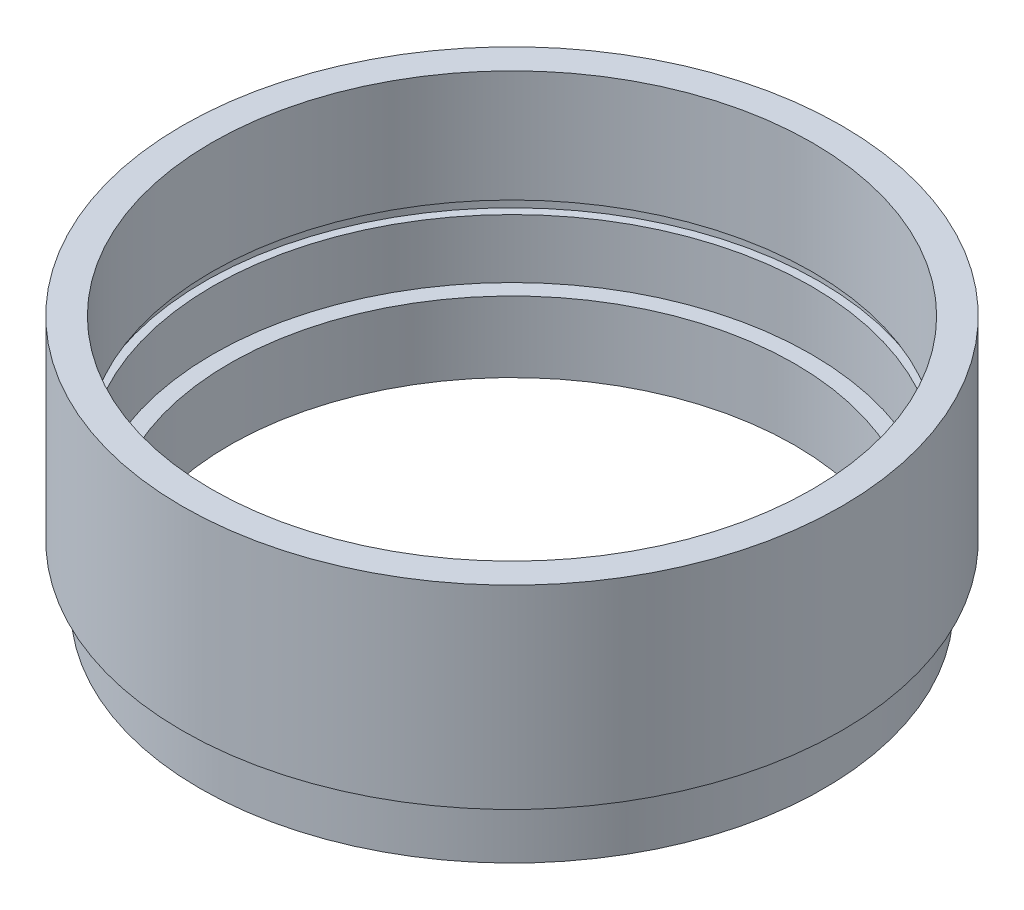
ISO-10303-21;
HEADER;
FILE_DESCRIPTION(('STEP AP214'),'2;1');
FILE_NAME('part.step','',(''),(''),'','','');
FILE_SCHEMA(('AUTOMOTIVE_DESIGN { 1 0 10303 214 1 1 1 1 }'));
ENDSEC;
DATA;
#1=APPLICATION_CONTEXT('core data for automotive mechanical design processes');
#2=APPLICATION_PROTOCOL_DEFINITION('international standard','automotive_design',2000,#1);
#3=PRODUCT_CONTEXT('',#1,'mechanical');
#4=PRODUCT('Part','Part','',(#3));
#5=PRODUCT_RELATED_PRODUCT_CATEGORY('part','',(#4));
#6=PRODUCT_DEFINITION_FORMATION('','',#4);
#7=PRODUCT_DEFINITION_CONTEXT('part definition',#1,'design');
#8=PRODUCT_DEFINITION('design','',#6,#7);
#9=PRODUCT_DEFINITION_SHAPE('','',#8);
#10=(LENGTH_UNIT() NAMED_UNIT(*) SI_UNIT(.MILLI.,.METRE.));
#11=(NAMED_UNIT(*) PLANE_ANGLE_UNIT() SI_UNIT($,.RADIAN.));
#12=(NAMED_UNIT(*) SI_UNIT($,.STERADIAN.) SOLID_ANGLE_UNIT());
#13=UNCERTAINTY_MEASURE_WITH_UNIT(LENGTH_MEASURE(1.E-05),#10,'distance_accuracy_value','');
#14=(GEOMETRIC_REPRESENTATION_CONTEXT(3) GLOBAL_UNCERTAINTY_ASSIGNED_CONTEXT((#13)) GLOBAL_UNIT_ASSIGNED_CONTEXT((#10,
#11,#12)) REPRESENTATION_CONTEXT('',''));
#15=CARTESIAN_POINT('',(0.,0.,0.));
#16=DIRECTION('',(0.,0.,1.));
#17=DIRECTION('',(1.,0.,0.));
#18=AXIS2_PLACEMENT_3D('',#15,#16,#17);
#19=CARTESIAN_POINT('',(0.,0.,0.));
#20=DIRECTION('',(0.,-1.,0.));
#21=DIRECTION('',(0.,0.,-1.));
#22=AXIS2_PLACEMENT_3D('',#19,#20,#21);
#23=CYLINDRICAL_SURFACE('',#22,24.);
#24=CARTESIAN_POINT('',(0.,0.,0.));
#25=DIRECTION('',(0.,-1.,0.));
#26=DIRECTION('',(0.,0.,-1.));
#27=AXIS2_PLACEMENT_3D('',#24,#25,#26);
#28=CIRCLE('',#27,24.);
#29=CARTESIAN_POINT('',(0.,0.,-24.));
#30=VERTEX_POINT('',#29);
#31=EDGE_CURVE('E10',#30,#30,#28,.T.);
#32=ORIENTED_EDGE('',*,*,#31,.T.);
#33=EDGE_LOOP('',(#32));
#34=FACE_BOUND('',#33,.T.);
#35=CARTESIAN_POINT('',(0.,6.,0.));
#36=DIRECTION('',(0.,-1.,0.));
#37=DIRECTION('',(0.,0.,-1.));
#38=AXIS2_PLACEMENT_3D('',#35,#36,#37);
#39=CIRCLE('',#38,24.);
#40=CARTESIAN_POINT('',(0.,6.,-24.));
#41=VERTEX_POINT('',#40);
#42=EDGE_CURVE('E81',#41,#41,#39,.T.);
#43=ORIENTED_EDGE('',*,*,#42,.F.);
#44=EDGE_LOOP('',(#43));
#45=FACE_BOUND('',#44,.T.);
#46=ADVANCED_FACE('F35',(#34,#45),#23,.F.);
#47=CARTESIAN_POINT('',(24.,0.,0.));
#48=DIRECTION('',(0.,-1.,0.));
#49=DIRECTION('',(0.,0.,-1.));
#50=AXIS2_PLACEMENT_3D('',#47,#48,#49);
#51=PLANE('',#50);
#52=CARTESIAN_POINT('',(0.,0.,0.));
#53=DIRECTION('',(0.,-1.,0.));
#54=DIRECTION('',(0.,0.,-1.));
#55=AXIS2_PLACEMENT_3D('',#52,#53,#54);
#56=CIRCLE('',#55,26.5);
#57=CARTESIAN_POINT('',(0.,0.,-26.5));
#58=VERTEX_POINT('',#57);
#59=EDGE_CURVE('E41',#58,#58,#56,.T.);
#60=ORIENTED_EDGE('',*,*,#59,.T.);
#61=EDGE_LOOP('',(#60));
#62=FACE_BOUND('',#61,.T.);
#63=ORIENTED_EDGE('',*,*,#31,.F.);
#64=EDGE_LOOP('',(#63));
#65=FACE_BOUND('',#64,.T.);
#66=ADVANCED_FACE('F89',(#62,#65),#51,.T.);
#67=CARTESIAN_POINT('',(0.,0.,0.));
#68=DIRECTION('',(0.,-1.,0.));
#69=DIRECTION('',(0.,0.,-1.));
#70=AXIS2_PLACEMENT_3D('',#67,#68,#69);
#71=CYLINDRICAL_SURFACE('',#70,26.5);
#72=CARTESIAN_POINT('',(0.,4.,0.));
#73=DIRECTION('',(0.,-1.,0.));
#74=DIRECTION('',(0.,0.,-1.));
#75=AXIS2_PLACEMENT_3D('',#72,#73,#74);
#76=CIRCLE('',#75,26.5);
#77=CARTESIAN_POINT('',(0.,4.,-26.5));
#78=VERTEX_POINT('',#77);
#79=EDGE_CURVE('E45',#78,#78,#76,.T.);
#80=ORIENTED_EDGE('',*,*,#79,.T.);
#81=EDGE_LOOP('',(#80));
#82=FACE_BOUND('',#81,.T.);
#83=ORIENTED_EDGE('',*,*,#59,.F.);
#84=EDGE_LOOP('',(#83));
#85=FACE_BOUND('',#84,.T.);
#86=ADVANCED_FACE('F93',(#82,#85),#71,.T.);
#87=CARTESIAN_POINT('',(26.5,4.,0.));
#88=DIRECTION('',(0.,1.,0.));
#89=DIRECTION('',(0.,0.,1.));
#90=AXIS2_PLACEMENT_3D('',#87,#88,#89);
#91=PLANE('',#90);
#92=CARTESIAN_POINT('',(0.,4.,0.));
#93=DIRECTION('',(0.,-1.,0.));
#94=DIRECTION('',(0.,0.,-1.));
#95=AXIS2_PLACEMENT_3D('',#92,#93,#94);
#96=CIRCLE('',#95,25.5);
#97=CARTESIAN_POINT('',(0.,4.,-25.5));
#98=VERTEX_POINT('',#97);
#99=EDGE_CURVE('E49',#98,#98,#96,.T.);
#100=ORIENTED_EDGE('',*,*,#99,.T.);
#101=EDGE_LOOP('',(#100));
#102=FACE_BOUND('',#101,.T.);
#103=ORIENTED_EDGE('',*,*,#79,.F.);
#104=EDGE_LOOP('',(#103));
#105=FACE_BOUND('',#104,.T.);
#106=ADVANCED_FACE('F97',(#102,#105),#91,.T.);
#107=CARTESIAN_POINT('',(0.,0.,0.));
#108=DIRECTION('',(0.,-1.,0.));
#109=DIRECTION('',(0.,0.,-1.));
#110=AXIS2_PLACEMENT_3D('',#107,#108,#109);
#111=CYLINDRICAL_SURFACE('',#110,25.5);
#112=CARTESIAN_POINT('',(0.,5.,0.));
#113=DIRECTION('',(0.,-1.,0.));
#114=DIRECTION('',(0.,0.,-1.));
#115=AXIS2_PLACEMENT_3D('',#112,#113,#114);
#116=CIRCLE('',#115,25.5);
#117=CARTESIAN_POINT('',(0.,5.,-25.5));
#118=VERTEX_POINT('',#117);
#119=EDGE_CURVE('E54',#118,#118,#116,.T.);
#120=ORIENTED_EDGE('',*,*,#119,.T.);
#121=EDGE_LOOP('',(#120));
#122=FACE_BOUND('',#121,.T.);
#123=ORIENTED_EDGE('',*,*,#99,.F.);
#124=EDGE_LOOP('',(#123));
#125=FACE_BOUND('',#124,.T.);
#126=ADVANCED_FACE('F104',(#122,#125),#111,.T.);
#127=CARTESIAN_POINT('',(25.5,5.,0.));
#128=DIRECTION('',(0.,-1.,0.));
#129=DIRECTION('',(0.,0.,-1.));
#130=AXIS2_PLACEMENT_3D('',#127,#128,#129);
#131=PLANE('',#130);
#132=CARTESIAN_POINT('',(0.,5.,0.));
#133=DIRECTION('',(0.,-1.,0.));
#134=DIRECTION('',(0.,0.,-1.));
#135=AXIS2_PLACEMENT_3D('',#132,#133,#134);
#136=CIRCLE('',#135,28.);
#137=CARTESIAN_POINT('',(0.,5.,-28.));
#138=VERTEX_POINT('',#137);
#139=EDGE_CURVE('E57',#138,#138,#136,.T.);
#140=ORIENTED_EDGE('',*,*,#139,.T.);
#141=EDGE_LOOP('',(#140));
#142=FACE_BOUND('',#141,.T.);
#143=ORIENTED_EDGE('',*,*,#119,.F.);
#144=EDGE_LOOP('',(#143));
#145=FACE_BOUND('',#144,.T.);
#146=ADVANCED_FACE('F108',(#142,#145),#131,.T.);
#147=CARTESIAN_POINT('',(0.,0.,0.));
#148=DIRECTION('',(0.,-1.,0.));
#149=DIRECTION('',(0.,0.,-1.));
#150=AXIS2_PLACEMENT_3D('',#147,#148,#149);
#151=CYLINDRICAL_SURFACE('',#150,28.);
#152=CARTESIAN_POINT('',(0.,21.5,0.));
#153=DIRECTION('',(0.,-1.,0.));
#154=DIRECTION('',(0.,0.,-1.));
#155=AXIS2_PLACEMENT_3D('',#152,#153,#154);
#156=CIRCLE('',#155,28.);
#157=CARTESIAN_POINT('',(0.,21.5,-28.));
#158=VERTEX_POINT('',#157);
#159=EDGE_CURVE('E60',#158,#158,#156,.T.);
#160=ORIENTED_EDGE('',*,*,#159,.T.);
#161=EDGE_LOOP('',(#160));
#162=FACE_BOUND('',#161,.T.);
#163=ORIENTED_EDGE('',*,*,#139,.F.);
#164=EDGE_LOOP('',(#163));
#165=FACE_BOUND('',#164,.T.);
#166=ADVANCED_FACE('F112',(#162,#165),#151,.T.);
#167=CARTESIAN_POINT('',(28.,21.5,0.));
#168=DIRECTION('',(0.,1.,0.));
#169=DIRECTION('',(0.,0.,1.));
#170=AXIS2_PLACEMENT_3D('',#167,#168,#169);
#171=PLANE('',#170);
#172=CARTESIAN_POINT('',(0.,21.5,0.));
#173=DIRECTION('',(0.,-1.,0.));
#174=DIRECTION('',(0.,0.,-1.));
#175=AXIS2_PLACEMENT_3D('',#172,#173,#174);
#176=CIRCLE('',#175,25.5);
#177=CARTESIAN_POINT('',(0.,21.5,-25.5));
#178=VERTEX_POINT('',#177);
#179=EDGE_CURVE('E63',#178,#178,#176,.T.);
#180=ORIENTED_EDGE('',*,*,#179,.T.);
#181=EDGE_LOOP('',(#180));
#182=FACE_BOUND('',#181,.T.);
#183=ORIENTED_EDGE('',*,*,#159,.F.);
#184=EDGE_LOOP('',(#183));
#185=FACE_BOUND('',#184,.T.);
#186=ADVANCED_FACE('F116',(#182,#185),#171,.T.);
#187=CARTESIAN_POINT('',(0.,0.,0.));
#188=DIRECTION('',(0.,-1.,0.));
#189=DIRECTION('',(0.,0.,-1.));
#190=AXIS2_PLACEMENT_3D('',#187,#188,#189);
#191=CYLINDRICAL_SURFACE('',#190,25.5);
#192=CARTESIAN_POINT('',(0.,12.,0.));
#193=DIRECTION('',(0.,-1.,0.));
#194=DIRECTION('',(0.,0.,-1.));
#195=AXIS2_PLACEMENT_3D('',#192,#193,#194);
#196=CIRCLE('',#195,25.5);
#197=CARTESIAN_POINT('',(0.,12.,-25.5));
#198=VERTEX_POINT('',#197);
#199=EDGE_CURVE('E66',#198,#198,#196,.T.);
#200=ORIENTED_EDGE('',*,*,#199,.T.);
#201=EDGE_LOOP('',(#200));
#202=FACE_BOUND('',#201,.T.);
#203=ORIENTED_EDGE('',*,*,#179,.F.);
#204=EDGE_LOOP('',(#203));
#205=FACE_BOUND('',#204,.T.);
#206=ADVANCED_FACE('F120',(#202,#205),#191,.F.);
#207=CARTESIAN_POINT('',(25.5,12.,0.));
#208=DIRECTION('',(0.,-1.,0.));
#209=DIRECTION('',(0.,0.,-1.));
#210=AXIS2_PLACEMENT_3D('',#207,#208,#209);
#211=PLANE('',#210);
#212=CARTESIAN_POINT('',(0.,12.,0.));
#213=DIRECTION('',(0.,-1.,0.));
#214=DIRECTION('',(0.,0.,-1.));
#215=AXIS2_PLACEMENT_3D('',#212,#213,#214);
#216=CIRCLE('',#215,26.1);
#217=CARTESIAN_POINT('',(0.,12.,-26.1));
#218=VERTEX_POINT('',#217);
#219=EDGE_CURVE('E69',#218,#218,#216,.T.);
#220=ORIENTED_EDGE('',*,*,#219,.T.);
#221=EDGE_LOOP('',(#220));
#222=FACE_BOUND('',#221,.T.);
#223=ORIENTED_EDGE('',*,*,#199,.F.);
#224=EDGE_LOOP('',(#223));
#225=FACE_BOUND('',#224,.T.);
#226=ADVANCED_FACE('F124',(#222,#225),#211,.T.);
#227=CARTESIAN_POINT('',(0.,0.,0.));
#228=DIRECTION('',(0.,-1.,0.));
#229=DIRECTION('',(0.,0.,-1.));
#230=AXIS2_PLACEMENT_3D('',#227,#228,#229);
#231=CYLINDRICAL_SURFACE('',#230,26.1);
#232=CARTESIAN_POINT('',(0.,11.,0.));
#233=DIRECTION('',(0.,-1.,0.));
#234=DIRECTION('',(0.,0.,-1.));
#235=AXIS2_PLACEMENT_3D('',#232,#233,#234);
#236=CIRCLE('',#235,26.1);
#237=CARTESIAN_POINT('',(0.,11.,-26.1));
#238=VERTEX_POINT('',#237);
#239=EDGE_CURVE('E72',#238,#238,#236,.T.);
#240=ORIENTED_EDGE('',*,*,#239,.T.);
#241=EDGE_LOOP('',(#240));
#242=FACE_BOUND('',#241,.T.);
#243=ORIENTED_EDGE('',*,*,#219,.F.);
#244=EDGE_LOOP('',(#243));
#245=FACE_BOUND('',#244,.T.);
#246=ADVANCED_FACE('F128',(#242,#245),#231,.F.);
#247=CARTESIAN_POINT('',(26.1,11.,0.));
#248=DIRECTION('',(0.,1.,0.));
#249=DIRECTION('',(0.,0.,1.));
#250=AXIS2_PLACEMENT_3D('',#247,#248,#249);
#251=PLANE('',#250);
#252=CARTESIAN_POINT('',(0.,11.,0.));
#253=DIRECTION('',(0.,-1.,0.));
#254=DIRECTION('',(0.,0.,-1.));
#255=AXIS2_PLACEMENT_3D('',#252,#253,#254);
#256=CIRCLE('',#255,25.4);
#257=CARTESIAN_POINT('',(0.,11.,-25.4));
#258=VERTEX_POINT('',#257);
#259=EDGE_CURVE('E75',#258,#258,#256,.T.);
#260=ORIENTED_EDGE('',*,*,#259,.T.);
#261=EDGE_LOOP('',(#260));
#262=FACE_BOUND('',#261,.T.);
#263=ORIENTED_EDGE('',*,*,#239,.F.);
#264=EDGE_LOOP('',(#263));
#265=FACE_BOUND('',#264,.T.);
#266=ADVANCED_FACE('F132',(#262,#265),#251,.T.);
#267=CARTESIAN_POINT('',(0.,0.,0.));
#268=DIRECTION('',(0.,-1.,0.));
#269=DIRECTION('',(0.,0.,-1.));
#270=AXIS2_PLACEMENT_3D('',#267,#268,#269);
#271=CYLINDRICAL_SURFACE('',#270,25.4);
#272=CARTESIAN_POINT('',(0.,6.,0.));
#273=DIRECTION('',(0.,-1.,0.));
#274=DIRECTION('',(0.,0.,-1.));
#275=AXIS2_PLACEMENT_3D('',#272,#273,#274);
#276=CIRCLE('',#275,25.4);
#277=CARTESIAN_POINT('',(0.,6.,-25.4));
#278=VERTEX_POINT('',#277);
#279=EDGE_CURVE('E78',#278,#278,#276,.T.);
#280=ORIENTED_EDGE('',*,*,#279,.T.);
#281=EDGE_LOOP('',(#280));
#282=FACE_BOUND('',#281,.T.);
#283=ORIENTED_EDGE('',*,*,#259,.F.);
#284=EDGE_LOOP('',(#283));
#285=FACE_BOUND('',#284,.T.);
#286=ADVANCED_FACE('F136',(#282,#285),#271,.F.);
#287=CARTESIAN_POINT('',(25.4,6.,0.));
#288=DIRECTION('',(0.,1.,0.));
#289=DIRECTION('',(0.,0.,1.));
#290=AXIS2_PLACEMENT_3D('',#287,#288,#289);
#291=PLANE('',#290);
#292=ORIENTED_EDGE('',*,*,#42,.T.);
#293=EDGE_LOOP('',(#292));
#294=FACE_BOUND('',#293,.T.);
#295=ORIENTED_EDGE('',*,*,#279,.F.);
#296=EDGE_LOOP('',(#295));
#297=FACE_BOUND('',#296,.T.);
#298=ADVANCED_FACE('F85',(#294,#297),#291,.T.);
#299=CLOSED_SHELL('',(#46,#66,#86,#106,#126,#146,#166,#186,#206,#226,#246,#266,#286,#298));
#300=MANIFOLD_SOLID_BREP('B2',#299);
#301=ADVANCED_BREP_SHAPE_REPRESENTATION('',(#18,#300),#14);
#302=SHAPE_DEFINITION_REPRESENTATION(#9,#301);
ENDSEC;
END-ISO-10303-21;
